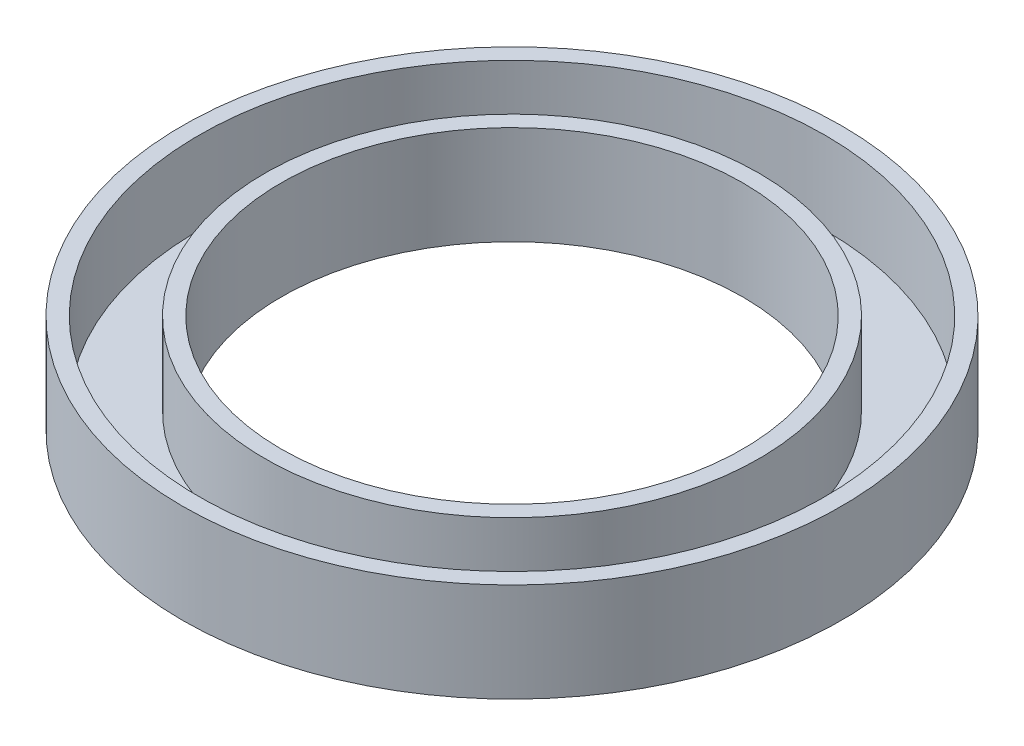
ISO-10303-21;
HEADER;
FILE_DESCRIPTION(('STEP AP214'),'2;1');
FILE_NAME('part.step','',(''),(''),'','','');
FILE_SCHEMA(('AUTOMOTIVE_DESIGN { 1 0 10303 214 1 1 1 1 }'));
ENDSEC;
DATA;
#1=APPLICATION_CONTEXT('core data for automotive mechanical design processes');
#2=APPLICATION_PROTOCOL_DEFINITION('international standard','automotive_design',2000,#1);
#3=PRODUCT_CONTEXT('',#1,'mechanical');
#4=PRODUCT('Part','Part','',(#3));
#5=PRODUCT_RELATED_PRODUCT_CATEGORY('part','',(#4));
#6=PRODUCT_DEFINITION_FORMATION('','',#4);
#7=PRODUCT_DEFINITION_CONTEXT('part definition',#1,'design');
#8=PRODUCT_DEFINITION('design','',#6,#7);
#9=PRODUCT_DEFINITION_SHAPE('','',#8);
#10=(LENGTH_UNIT() NAMED_UNIT(*) SI_UNIT(.MILLI.,.METRE.));
#11=(NAMED_UNIT(*) PLANE_ANGLE_UNIT() SI_UNIT($,.RADIAN.));
#12=(NAMED_UNIT(*) SI_UNIT($,.STERADIAN.) SOLID_ANGLE_UNIT());
#13=UNCERTAINTY_MEASURE_WITH_UNIT(LENGTH_MEASURE(1.E-05),#10,'distance_accuracy_value','');
#14=(GEOMETRIC_REPRESENTATION_CONTEXT(3) GLOBAL_UNCERTAINTY_ASSIGNED_CONTEXT((#13)) GLOBAL_UNIT_ASSIGNED_CONTEXT((#10,
#11,#12)) REPRESENTATION_CONTEXT('',''));
#15=CARTESIAN_POINT('',(0.,0.,0.));
#16=DIRECTION('',(0.,0.,1.));
#17=DIRECTION('',(1.,0.,0.));
#18=AXIS2_PLACEMENT_3D('',#15,#16,#17);
#19=CARTESIAN_POINT('',(-15.08125,4.7625,0.));
#20=DIRECTION('',(0.,-1.,0.));
#21=DIRECTION('',(0.,0.,-1.));
#22=AXIS2_PLACEMENT_3D('',#19,#20,#21);
#23=PLANE('',#22);
#24=CARTESIAN_POINT('',(0.,4.7625,0.));
#25=DIRECTION('',(0.,-1.,0.));
#26=DIRECTION('',(0.,0.,-1.));
#27=AXIS2_PLACEMENT_3D('',#24,#25,#26);
#28=CIRCLE('',#27,15.875);
#29=CARTESIAN_POINT('',(0.,4.7625,-15.875));
#30=VERTEX_POINT('',#29);
#31=EDGE_CURVE('E10',#30,#30,#28,.T.);
#32=ORIENTED_EDGE('',*,*,#31,.F.);
#33=EDGE_LOOP('',(#32));
#34=FACE_BOUND('',#33,.T.);
#35=CARTESIAN_POINT('',(0.,4.7625,0.));
#36=DIRECTION('',(0.,-1.,0.));
#37=DIRECTION('',(0.,0.,-1.));
#38=AXIS2_PLACEMENT_3D('',#35,#36,#37);
#39=CIRCLE('',#38,15.08125);
#40=CARTESIAN_POINT('',(0.,4.7625,-15.08125));
#41=VERTEX_POINT('',#40);
#42=EDGE_CURVE('E59',#41,#41,#39,.T.);
#43=ORIENTED_EDGE('',*,*,#42,.T.);
#44=EDGE_LOOP('',(#43));
#45=FACE_BOUND('',#44,.T.);
#46=ADVANCED_FACE('F31',(#34,#45),#23,.F.);
#47=CARTESIAN_POINT('',(0.,0.,0.));
#48=DIRECTION('',(0.,-1.,0.));
#49=DIRECTION('',(0.,0.,-1.));
#50=AXIS2_PLACEMENT_3D('',#47,#48,#49);
#51=CYLINDRICAL_SURFACE('',#50,15.875);
#52=CARTESIAN_POINT('',(0.,0.,0.));
#53=DIRECTION('',(0.,-1.,0.));
#54=DIRECTION('',(0.,0.,-1.));
#55=AXIS2_PLACEMENT_3D('',#52,#53,#54);
#56=CIRCLE('',#55,15.875);
#57=CARTESIAN_POINT('',(0.,0.,-15.875));
#58=VERTEX_POINT('',#57);
#59=EDGE_CURVE('E37',#58,#58,#56,.T.);
#60=ORIENTED_EDGE('',*,*,#59,.F.);
#61=EDGE_LOOP('',(#60));
#62=FACE_BOUND('',#61,.T.);
#63=ORIENTED_EDGE('',*,*,#31,.T.);
#64=EDGE_LOOP('',(#63));
#65=FACE_BOUND('',#64,.T.);
#66=ADVANCED_FACE('F96',(#62,#65),#51,.T.);
#67=CARTESIAN_POINT('',(-15.875,0.,0.));
#68=DIRECTION('',(0.,1.,0.));
#69=DIRECTION('',(0.,0.,1.));
#70=AXIS2_PLACEMENT_3D('',#67,#68,#69);
#71=PLANE('',#70);
#72=CARTESIAN_POINT('',(0.,0.,0.));
#73=DIRECTION('',(0.,-1.,0.));
#74=DIRECTION('',(0.,0.,-1.));
#75=AXIS2_PLACEMENT_3D('',#72,#73,#74);
#76=CIRCLE('',#75,11.1125);
#77=CARTESIAN_POINT('',(0.,0.,-11.1125));
#78=VERTEX_POINT('',#77);
#79=EDGE_CURVE('E41',#78,#78,#76,.T.);
#80=ORIENTED_EDGE('',*,*,#79,.F.);
#81=EDGE_LOOP('',(#80));
#82=FACE_BOUND('',#81,.T.);
#83=ORIENTED_EDGE('',*,*,#59,.T.);
#84=EDGE_LOOP('',(#83));
#85=FACE_BOUND('',#84,.T.);
#86=ADVANCED_FACE('F91',(#82,#85),#71,.F.);
#87=CARTESIAN_POINT('',(0.,0.,0.));
#88=DIRECTION('',(0.,-1.,0.));
#89=DIRECTION('',(0.,0.,-1.));
#90=AXIS2_PLACEMENT_3D('',#87,#88,#89);
#91=CYLINDRICAL_SURFACE('',#90,11.1125);
#92=CARTESIAN_POINT('',(0.,4.7625,0.));
#93=DIRECTION('',(0.,-1.,0.));
#94=DIRECTION('',(0.,0.,-1.));
#95=AXIS2_PLACEMENT_3D('',#92,#93,#94);
#96=CIRCLE('',#95,11.1125);
#97=CARTESIAN_POINT('',(0.,4.7625,-11.1125));
#98=VERTEX_POINT('',#97);
#99=EDGE_CURVE('E45',#98,#98,#96,.T.);
#100=ORIENTED_EDGE('',*,*,#99,.F.);
#101=EDGE_LOOP('',(#100));
#102=FACE_BOUND('',#101,.T.);
#103=ORIENTED_EDGE('',*,*,#79,.T.);
#104=EDGE_LOOP('',(#103));
#105=FACE_BOUND('',#104,.T.);
#106=ADVANCED_FACE('F85',(#102,#105),#91,.F.);
#107=CARTESIAN_POINT('',(-11.1125,4.7625,0.));
#108=DIRECTION('',(0.,-1.,0.));
#109=DIRECTION('',(0.,0.,-1.));
#110=AXIS2_PLACEMENT_3D('',#107,#108,#109);
#111=PLANE('',#110);
#112=CARTESIAN_POINT('',(0.,4.7625,0.));
#113=DIRECTION('',(0.,-1.,0.));
#114=DIRECTION('',(0.,0.,-1.));
#115=AXIS2_PLACEMENT_3D('',#112,#113,#114);
#116=CIRCLE('',#115,11.90625);
#117=CARTESIAN_POINT('',(0.,4.7625,-11.90625));
#118=VERTEX_POINT('',#117);
#119=EDGE_CURVE('E50',#118,#118,#116,.T.);
#120=ORIENTED_EDGE('',*,*,#119,.F.);
#121=EDGE_LOOP('',(#120));
#122=FACE_BOUND('',#121,.T.);
#123=ORIENTED_EDGE('',*,*,#99,.T.);
#124=EDGE_LOOP('',(#123));
#125=FACE_BOUND('',#124,.T.);
#126=ADVANCED_FACE('F79',(#122,#125),#111,.F.);
#127=CARTESIAN_POINT('',(0.,0.,0.));
#128=DIRECTION('',(0.,-1.,0.));
#129=DIRECTION('',(0.,0.,-1.));
#130=AXIS2_PLACEMENT_3D('',#127,#128,#129);
#131=CYLINDRICAL_SURFACE('',#130,11.90625);
#132=CARTESIAN_POINT('',(0.,0.79375,0.));
#133=DIRECTION('',(0.,-1.,0.));
#134=DIRECTION('',(0.,0.,-1.));
#135=AXIS2_PLACEMENT_3D('',#132,#133,#134);
#136=CIRCLE('',#135,11.90625);
#137=CARTESIAN_POINT('',(0.,0.79375,-11.90625));
#138=VERTEX_POINT('',#137);
#139=EDGE_CURVE('E53',#138,#138,#136,.T.);
#140=ORIENTED_EDGE('',*,*,#139,.F.);
#141=EDGE_LOOP('',(#140));
#142=FACE_BOUND('',#141,.T.);
#143=ORIENTED_EDGE('',*,*,#119,.T.);
#144=EDGE_LOOP('',(#143));
#145=FACE_BOUND('',#144,.T.);
#146=ADVANCED_FACE('F73',(#142,#145),#131,.T.);
#147=CARTESIAN_POINT('',(-11.90625,0.79375,0.));
#148=DIRECTION('',(0.,-1.,0.));
#149=DIRECTION('',(0.,0.,-1.));
#150=AXIS2_PLACEMENT_3D('',#147,#148,#149);
#151=PLANE('',#150);
#152=CARTESIAN_POINT('',(0.,0.79375,0.));
#153=DIRECTION('',(0.,-1.,0.));
#154=DIRECTION('',(0.,0.,-1.));
#155=AXIS2_PLACEMENT_3D('',#152,#153,#154);
#156=CIRCLE('',#155,15.08125);
#157=CARTESIAN_POINT('',(0.,0.79375,-15.08125));
#158=VERTEX_POINT('',#157);
#159=EDGE_CURVE('E56',#158,#158,#156,.T.);
#160=ORIENTED_EDGE('',*,*,#159,.F.);
#161=EDGE_LOOP('',(#160));
#162=FACE_BOUND('',#161,.T.);
#163=ORIENTED_EDGE('',*,*,#139,.T.);
#164=EDGE_LOOP('',(#163));
#165=FACE_BOUND('',#164,.T.);
#166=ADVANCED_FACE('F67',(#162,#165),#151,.F.);
#167=CARTESIAN_POINT('',(0.,0.,0.));
#168=DIRECTION('',(0.,-1.,0.));
#169=DIRECTION('',(0.,0.,-1.));
#170=AXIS2_PLACEMENT_3D('',#167,#168,#169);
#171=CYLINDRICAL_SURFACE('',#170,15.08125);
#172=ORIENTED_EDGE('',*,*,#42,.F.);
#173=EDGE_LOOP('',(#172));
#174=FACE_BOUND('',#173,.T.);
#175=ORIENTED_EDGE('',*,*,#159,.T.);
#176=EDGE_LOOP('',(#175));
#177=FACE_BOUND('',#176,.T.);
#178=ADVANCED_FACE('F64',(#174,#177),#171,.F.);
#179=CLOSED_SHELL('',(#46,#66,#86,#106,#126,#146,#166,#178));
#180=MANIFOLD_SOLID_BREP('B2',#179);
#181=ADVANCED_BREP_SHAPE_REPRESENTATION('',(#18,#180),#14);
#182=SHAPE_DEFINITION_REPRESENTATION(#9,#181);
ENDSEC;
END-ISO-10303-21;
